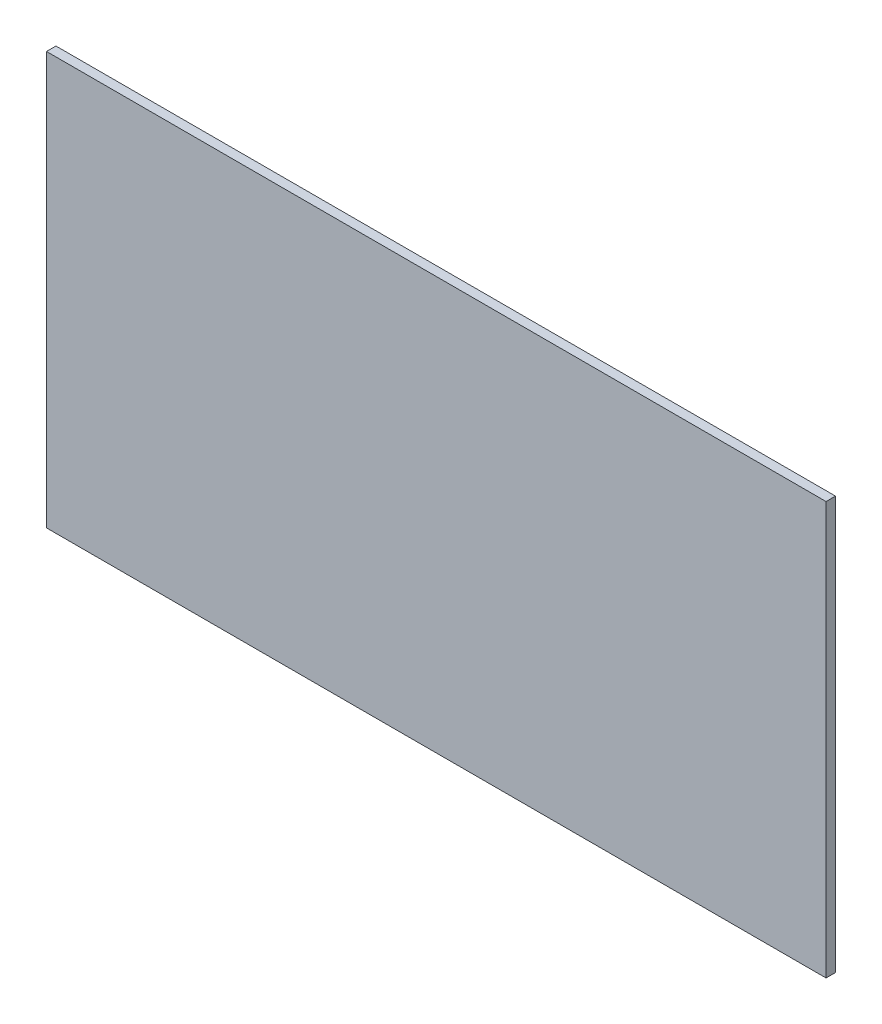
ISO-10303-21;
HEADER;
FILE_DESCRIPTION(('STEP AP214'),'2;1');
FILE_NAME('part.step','',(''),(''),'','','');
FILE_SCHEMA(('AUTOMOTIVE_DESIGN { 1 0 10303 214 1 1 1 1 }'));
ENDSEC;
DATA;
#1=APPLICATION_CONTEXT('core data for automotive mechanical design processes');
#2=APPLICATION_PROTOCOL_DEFINITION('international standard','automotive_design',2000,#1);
#3=PRODUCT_CONTEXT('',#1,'mechanical');
#4=PRODUCT('Part','Part','',(#3));
#5=PRODUCT_RELATED_PRODUCT_CATEGORY('part','',(#4));
#6=PRODUCT_DEFINITION_FORMATION('','',#4);
#7=PRODUCT_DEFINITION_CONTEXT('part definition',#1,'design');
#8=PRODUCT_DEFINITION('design','',#6,#7);
#9=PRODUCT_DEFINITION_SHAPE('','',#8);
#10=(LENGTH_UNIT() NAMED_UNIT(*) SI_UNIT(.MILLI.,.METRE.));
#11=(NAMED_UNIT(*) PLANE_ANGLE_UNIT() SI_UNIT($,.RADIAN.));
#12=(NAMED_UNIT(*) SI_UNIT($,.STERADIAN.) SOLID_ANGLE_UNIT());
#13=UNCERTAINTY_MEASURE_WITH_UNIT(LENGTH_MEASURE(1.E-05),#10,'distance_accuracy_value','');
#14=(GEOMETRIC_REPRESENTATION_CONTEXT(3) GLOBAL_UNCERTAINTY_ASSIGNED_CONTEXT((#13)) GLOBAL_UNIT_ASSIGNED_CONTEXT((#10,
#11,#12)) REPRESENTATION_CONTEXT('',''));
#15=CARTESIAN_POINT('',(0.,0.,0.));
#16=DIRECTION('',(0.,0.,1.));
#17=DIRECTION('',(1.,0.,0.));
#18=AXIS2_PLACEMENT_3D('',#15,#16,#17);
#19=CARTESIAN_POINT('',(8.01579234972678,-7.425,0.5));
#20=DIRECTION('',(-1.,0.,0.));
#21=DIRECTION('',(0.,0.,1.));
#22=AXIS2_PLACEMENT_3D('',#19,#20,#21);
#23=PLANE('',#22);
#24=DIRECTION('',(0.,1.,0.));
#25=VECTOR('',#24,1.);
#26=CARTESIAN_POINT('',(8.01579234972678,-7.425,0.));
#27=LINE('',#26,#25);
#28=CARTESIAN_POINT('',(8.01579234972678,-7.425,0.));
#29=VERTEX_POINT('',#28);
#30=CARTESIAN_POINT('',(8.01579234972678,14.425,0.));
#31=VERTEX_POINT('',#30);
#32=EDGE_CURVE('E99',#29,#31,#27,.T.);
#33=ORIENTED_EDGE('',*,*,#32,.T.);
#34=DIRECTION('',(0.,0.,-1.));
#35=VECTOR('',#34,1.);
#36=CARTESIAN_POINT('',(8.01579234972678,14.425,0.5));
#37=LINE('',#36,#35);
#38=CARTESIAN_POINT('',(8.01579234972678,14.425,0.5));
#39=VERTEX_POINT('',#38);
#40=EDGE_CURVE('E11',#39,#31,#37,.T.);
#41=ORIENTED_EDGE('',*,*,#40,.F.);
#42=DIRECTION('',(0.,1.,0.));
#43=VECTOR('',#42,1.);
#44=CARTESIAN_POINT('',(8.01579234972678,-7.425,0.5));
#45=LINE('',#44,#43);
#46=CARTESIAN_POINT('',(8.01579234972678,-7.425,0.5));
#47=VERTEX_POINT('',#46);
#48=EDGE_CURVE('E87',#47,#39,#45,.T.);
#49=ORIENTED_EDGE('',*,*,#48,.F.);
#50=DIRECTION('',(0.,0.,-1.));
#51=VECTOR('',#50,1.);
#52=CARTESIAN_POINT('',(8.01579234972678,-7.425,0.5));
#53=LINE('',#52,#51);
#54=EDGE_CURVE('E95',#47,#29,#53,.T.);
#55=ORIENTED_EDGE('',*,*,#54,.T.);
#56=EDGE_LOOP('',(#33,#41,#49,#55));
#57=FACE_BOUND('',#56,.T.);
#58=ADVANCED_FACE('F36',(#57),#23,.F.);
#59=CARTESIAN_POINT('',(-33.2642076502732,14.425,0.5));
#60=DIRECTION('',(0.,-1.,0.));
#61=DIRECTION('',(0.,0.,-1.));
#62=AXIS2_PLACEMENT_3D('',#59,#60,#61);
#63=PLANE('',#62);
#64=DIRECTION('',(-1.,0.,0.));
#65=VECTOR('',#64,1.);
#66=CARTESIAN_POINT('',(-33.2642076502732,14.425,0.));
#67=LINE('',#66,#65);
#68=CARTESIAN_POINT('',(-33.2642076502732,14.425,0.));
#69=VERTEX_POINT('',#68);
#70=EDGE_CURVE('E91',#31,#69,#67,.T.);
#71=ORIENTED_EDGE('',*,*,#70,.T.);
#72=DIRECTION('',(0.,0.,-1.));
#73=VECTOR('',#72,1.);
#74=CARTESIAN_POINT('',(-33.2642076502732,14.425,0.5));
#75=LINE('',#74,#73);
#76=CARTESIAN_POINT('',(-33.2642076502732,14.425,0.5));
#77=VERTEX_POINT('',#76);
#78=EDGE_CURVE('E44',#77,#69,#75,.T.);
#79=ORIENTED_EDGE('',*,*,#78,.F.);
#80=DIRECTION('',(-1.,0.,0.));
#81=VECTOR('',#80,1.);
#82=CARTESIAN_POINT('',(-33.2642076502732,14.425,0.5));
#83=LINE('',#82,#81);
#84=EDGE_CURVE('E82',#39,#77,#83,.T.);
#85=ORIENTED_EDGE('',*,*,#84,.F.);
#86=ORIENTED_EDGE('',*,*,#40,.T.);
#87=EDGE_LOOP('',(#71,#79,#85,#86));
#88=FACE_BOUND('',#87,.T.);
#89=ADVANCED_FACE('F90',(#88),#63,.F.);
#90=CARTESIAN_POINT('',(-33.2642076502732,-7.425,0.5));
#91=DIRECTION('',(1.,0.,0.));
#92=DIRECTION('',(0.,0.,-1.));
#93=AXIS2_PLACEMENT_3D('',#90,#91,#92);
#94=PLANE('',#93);
#95=DIRECTION('',(0.,-1.,0.));
#96=VECTOR('',#95,1.);
#97=CARTESIAN_POINT('',(-33.2642076502732,-7.425,0.));
#98=LINE('',#97,#96);
#99=CARTESIAN_POINT('',(-33.2642076502732,-7.425,0.));
#100=VERTEX_POINT('',#99);
#101=EDGE_CURVE('E69',#69,#100,#98,.T.);
#102=ORIENTED_EDGE('',*,*,#101,.T.);
#103=DIRECTION('',(0.,0.,-1.));
#104=VECTOR('',#103,1.);
#105=CARTESIAN_POINT('',(-33.2642076502732,-7.425,0.5));
#106=LINE('',#105,#104);
#107=CARTESIAN_POINT('',(-33.2642076502732,-7.425,0.5));
#108=VERTEX_POINT('',#107);
#109=EDGE_CURVE('E92',#108,#100,#106,.T.);
#110=ORIENTED_EDGE('',*,*,#109,.F.);
#111=DIRECTION('',(0.,-1.,0.));
#112=VECTOR('',#111,1.);
#113=CARTESIAN_POINT('',(-33.2642076502732,-7.425,0.5));
#114=LINE('',#113,#112);
#115=EDGE_CURVE('E85',#77,#108,#114,.T.);
#116=ORIENTED_EDGE('',*,*,#115,.F.);
#117=ORIENTED_EDGE('',*,*,#78,.T.);
#118=EDGE_LOOP('',(#102,#110,#116,#117));
#119=FACE_BOUND('',#118,.T.);
#120=ADVANCED_FACE('F93',(#119),#94,.F.);
#121=CARTESIAN_POINT('',(-33.2642076502732,-7.425,0.5));
#122=DIRECTION('',(0.,1.,0.));
#123=DIRECTION('',(0.,0.,1.));
#124=AXIS2_PLACEMENT_3D('',#121,#122,#123);
#125=PLANE('',#124);
#126=DIRECTION('',(1.,0.,0.));
#127=VECTOR('',#126,1.);
#128=CARTESIAN_POINT('',(-33.2642076502732,-7.425,0.));
#129=LINE('',#128,#127);
#130=EDGE_CURVE('E75',#100,#29,#129,.T.);
#131=ORIENTED_EDGE('',*,*,#130,.T.);
#132=ORIENTED_EDGE('',*,*,#54,.F.);
#133=DIRECTION('',(1.,0.,0.));
#134=VECTOR('',#133,1.);
#135=CARTESIAN_POINT('',(-33.2642076502732,-7.425,0.5));
#136=LINE('',#135,#134);
#137=EDGE_CURVE('E52',#108,#47,#136,.T.);
#138=ORIENTED_EDGE('',*,*,#137,.F.);
#139=ORIENTED_EDGE('',*,*,#109,.T.);
#140=EDGE_LOOP('',(#131,#132,#138,#139));
#141=FACE_BOUND('',#140,.T.);
#142=ADVANCED_FACE('F106',(#141),#125,.F.);
#143=CARTESIAN_POINT('',(0.,0.,0.5));
#144=DIRECTION('',(0.,0.,-1.));
#145=DIRECTION('',(-1.,0.,0.));
#146=AXIS2_PLACEMENT_3D('',#143,#144,#145);
#147=PLANE('',#146);
#148=ORIENTED_EDGE('',*,*,#48,.T.);
#149=ORIENTED_EDGE('',*,*,#84,.T.);
#150=ORIENTED_EDGE('',*,*,#115,.T.);
#151=ORIENTED_EDGE('',*,*,#137,.T.);
#152=EDGE_LOOP('',(#148,#149,#150,#151));
#153=FACE_BOUND('',#152,.T.);
#154=ADVANCED_FACE('F83',(#153),#147,.F.);
#155=CARTESIAN_POINT('',(0.,0.,0.));
#156=DIRECTION('',(0.,0.,-1.));
#157=DIRECTION('',(-1.,0.,0.));
#158=AXIS2_PLACEMENT_3D('',#155,#156,#157);
#159=PLANE('',#158);
#160=ORIENTED_EDGE('',*,*,#32,.F.);
#161=ORIENTED_EDGE('',*,*,#130,.F.);
#162=ORIENTED_EDGE('',*,*,#101,.F.);
#163=ORIENTED_EDGE('',*,*,#70,.F.);
#164=EDGE_LOOP('',(#160,#161,#162,#163));
#165=FACE_BOUND('',#164,.T.);
#166=ADVANCED_FACE('F109',(#165),#159,.T.);
#167=CLOSED_SHELL('',(#58,#89,#120,#142,#154,#166));
#168=MANIFOLD_SOLID_BREP('B2',#167);
#169=ADVANCED_BREP_SHAPE_REPRESENTATION('',(#18,#168),#14);
#170=SHAPE_DEFINITION_REPRESENTATION(#9,#169);
ENDSEC;
END-ISO-10303-21;
